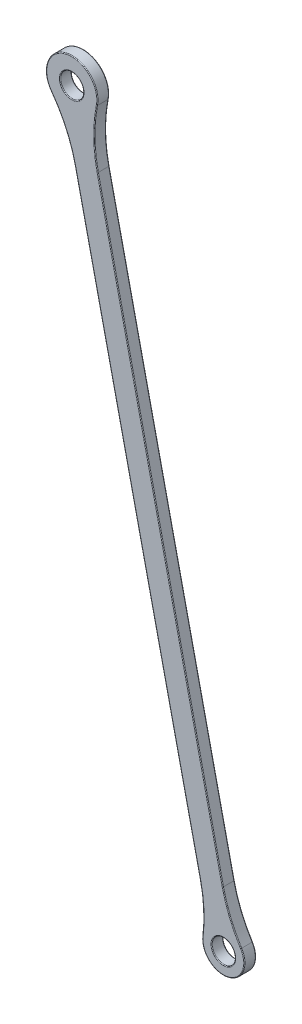
ISO-10303-21;
HEADER;
FILE_DESCRIPTION(('STEP AP214'),'2;1');
FILE_NAME('part.step','',(''),(''),'','','');
FILE_SCHEMA(('AUTOMOTIVE_DESIGN { 1 0 10303 214 1 1 1 1 }'));
ENDSEC;
DATA;
#1=APPLICATION_CONTEXT('core data for automotive mechanical design processes');
#2=APPLICATION_PROTOCOL_DEFINITION('international standard','automotive_design',2000,#1);
#3=PRODUCT_CONTEXT('',#1,'mechanical');
#4=PRODUCT('Part','Part','',(#3));
#5=PRODUCT_RELATED_PRODUCT_CATEGORY('part','',(#4));
#6=PRODUCT_DEFINITION_FORMATION('','',#4);
#7=PRODUCT_DEFINITION_CONTEXT('part definition',#1,'design');
#8=PRODUCT_DEFINITION('design','',#6,#7);
#9=PRODUCT_DEFINITION_SHAPE('','',#8);
#10=(LENGTH_UNIT() NAMED_UNIT(*) SI_UNIT(.MILLI.,.METRE.));
#11=(NAMED_UNIT(*) PLANE_ANGLE_UNIT() SI_UNIT($,.RADIAN.));
#12=(NAMED_UNIT(*) SI_UNIT($,.STERADIAN.) SOLID_ANGLE_UNIT());
#13=UNCERTAINTY_MEASURE_WITH_UNIT(LENGTH_MEASURE(1.E-05),#10,'distance_accuracy_value','');
#14=(GEOMETRIC_REPRESENTATION_CONTEXT(3) GLOBAL_UNCERTAINTY_ASSIGNED_CONTEXT((#13)) GLOBAL_UNIT_ASSIGNED_CONTEXT((#10,
#11,#12)) REPRESENTATION_CONTEXT('',''));
#15=CARTESIAN_POINT('',(0.,0.,0.));
#16=DIRECTION('',(0.,0.,1.));
#17=DIRECTION('',(1.,0.,0.));
#18=AXIS2_PLACEMENT_3D('',#15,#16,#17);
#19=CARTESIAN_POINT('',(28.8140334690027,6.4822013476046,-2.5));
#20=DIRECTION('',(0.975616689085578,0.219481379569418,0.));
#21=DIRECTION('',(-0.219481379569418,0.975616689085578,0.));
#22=AXIS2_PLACEMENT_3D('',#19,#20,#21);
#23=PLANE('',#22);
#24=DIRECTION('',(0.,0.,1.));
#25=VECTOR('',#24,1.);
#26=CARTESIAN_POINT('',(-17.2874647734743,211.407973025582,-2.5));
#27=LINE('',#26,#25);
#28=CARTESIAN_POINT('',(-17.2874647734743,211.407973025582,-0.15));
#29=VERTEX_POINT('',#28);
#30=CARTESIAN_POINT('',(-17.2874647734743,211.407973025582,-2.35));
#31=VERTEX_POINT('',#30);
#32=EDGE_CURVE('E302',#29,#31,#27,.F.);
#33=ORIENTED_EDGE('',*,*,#32,.T.);
#34=DIRECTION('',(-0.219481379569418,0.975616689085578,0.));
#35=VECTOR('',#34,1.);
#36=CARTESIAN_POINT('',(28.8140334690027,6.4822013476046,-2.35));
#37=LINE('',#36,#35);
#38=CARTESIAN_POINT('',(9.52027762419108,92.2448762235713,-2.35));
#39=VERTEX_POINT('',#38);
#40=EDGE_CURVE('E215',#31,#39,#37,.F.);
#41=ORIENTED_EDGE('',*,*,#40,.T.);
#42=DIRECTION('',(0.,0.,1.));
#43=VECTOR('',#42,1.);
#44=CARTESIAN_POINT('',(9.52027762419108,92.2448762235713,-2.5));
#45=LINE('',#44,#43);
#46=CARTESIAN_POINT('',(9.52027762419108,92.2448762235713,-0.15));
#47=VERTEX_POINT('',#46);
#48=EDGE_CURVE('E307',#39,#47,#45,.T.);
#49=ORIENTED_EDGE('',*,*,#48,.T.);
#50=DIRECTION('',(-0.219481379569418,0.975616689085578,0.));
#51=VECTOR('',#50,1.);
#52=CARTESIAN_POINT('',(-17.2874647734743,211.407973025582,-0.15));
#53=LINE('',#52,#51);
#54=EDGE_CURVE('E213',#47,#29,#53,.T.);
#55=ORIENTED_EDGE('',*,*,#54,.T.);
#56=EDGE_LOOP('',(#33,#41,#49,#55));
#57=FACE_BOUND('',#56,.T.);
#58=ADVANCED_FACE('F35',(#57),#23,.F.);
#59=CARTESIAN_POINT('',(-17.983244177946,225.891269992099,-2.5));
#60=DIRECTION('',(0.,0.,1.));
#61=DIRECTION('',(1.,0.,0.));
#62=AXIS2_PLACEMENT_3D('',#59,#60,#61);
#63=CYLINDRICAL_SURFACE('',#62,5.50000000000001);
#64=DIRECTION('',(0.,0.,1.));
#65=VECTOR('',#64,1.);
#66=CARTESIAN_POINT('',(-12.5851315195356,224.837524421712,-2.5));
#67=LINE('',#66,#65);
#68=CARTESIAN_POINT('',(-12.5851315195356,224.837524421712,-0.15));
#69=VERTEX_POINT('',#68);
#70=CARTESIAN_POINT('',(-12.5851315195356,224.837524421712,-2.35));
#71=VERTEX_POINT('',#70);
#72=EDGE_CURVE('E342',#69,#71,#67,.F.);
#73=ORIENTED_EDGE('',*,*,#72,.T.);
#74=CARTESIAN_POINT('',(-17.983244177946,225.891269992099,-2.35));
#75=DIRECTION('',(0.,0.,1.));
#76=DIRECTION('',(1.,0.,0.));
#77=AXIS2_PLACEMENT_3D('',#74,#75,#76);
#78=CIRCLE('',#77,5.50000000000001);
#79=CARTESIAN_POINT('',(-22.4100038110312,222.627254190837,-2.35));
#80=VERTEX_POINT('',#79);
#81=EDGE_CURVE('E206',#71,#80,#78,.T.);
#82=ORIENTED_EDGE('',*,*,#81,.T.);
#83=DIRECTION('',(0.,0.,1.));
#84=VECTOR('',#83,1.);
#85=CARTESIAN_POINT('',(-22.4100038110312,222.627254190837,-2.5));
#86=LINE('',#85,#84);
#87=CARTESIAN_POINT('',(-22.4100038110312,222.627254190837,-0.15));
#88=VERTEX_POINT('',#87);
#89=EDGE_CURVE('E337',#80,#88,#86,.T.);
#90=ORIENTED_EDGE('',*,*,#89,.T.);
#91=CARTESIAN_POINT('',(-17.983244177946,225.891269992099,-0.15));
#92=DIRECTION('',(0.,0.,1.));
#93=DIRECTION('',(1.,0.,0.));
#94=AXIS2_PLACEMENT_3D('',#91,#92,#93);
#95=CIRCLE('',#94,5.50000000000001);
#96=EDGE_CURVE('E204',#88,#69,#95,.F.);
#97=ORIENTED_EDGE('',*,*,#96,.T.);
#98=EDGE_LOOP('',(#73,#82,#90,#97));
#99=FACE_BOUND('',#98,.T.);
#100=ADVANCED_FACE('F371',(#99),#63,.T.);
#101=CARTESIAN_POINT('',(33.6921169144306,7.57960824545169,-2.5));
#102=DIRECTION('',(0.975616689085578,0.219481379569418,0.));
#103=DIRECTION('',(-0.219481379569418,0.975616689085578,0.));
#104=AXIS2_PLACEMENT_3D('',#101,#102,#103);
#105=PLANE('',#104);
#106=DIRECTION('',(0.,0.,-1.));
#107=VECTOR('',#106,1.);
#108=CARTESIAN_POINT('',(14.398361069619,93.3422831214184,-2.5));
#109=LINE('',#108,#107);
#110=CARTESIAN_POINT('',(14.398361069619,93.3422831214184,-0.15));
#111=VERTEX_POINT('',#110);
#112=CARTESIAN_POINT('',(14.398361069619,93.3422831214184,-2.35));
#113=VERTEX_POINT('',#112);
#114=EDGE_CURVE('E258',#111,#113,#109,.T.);
#115=ORIENTED_EDGE('',*,*,#114,.T.);
#116=DIRECTION('',(-0.219481379569418,0.975616689085578,0.));
#117=VECTOR('',#116,1.);
#118=CARTESIAN_POINT('',(-12.4093813280464,212.505379923429,-2.35));
#119=LINE('',#118,#117);
#120=CARTESIAN_POINT('',(-12.4093813280464,212.505379923429,-2.35));
#121=VERTEX_POINT('',#120);
#122=EDGE_CURVE('E198',#113,#121,#119,.T.);
#123=ORIENTED_EDGE('',*,*,#122,.T.);
#124=DIRECTION('',(0.,0.,-1.));
#125=VECTOR('',#124,1.);
#126=CARTESIAN_POINT('',(-12.4093813280464,212.505379923429,0.));
#127=LINE('',#126,#125);
#128=CARTESIAN_POINT('',(-12.4093813280464,212.505379923429,-0.15));
#129=VERTEX_POINT('',#128);
#130=EDGE_CURVE('E335',#121,#129,#127,.F.);
#131=ORIENTED_EDGE('',*,*,#130,.T.);
#132=DIRECTION('',(-0.219481379569418,0.975616689085578,0.));
#133=VECTOR('',#132,1.);
#134=CARTESIAN_POINT('',(33.6921169144306,7.57960824545169,-0.15));
#135=LINE('',#134,#133);
#136=EDGE_CURVE('E196',#129,#111,#135,.F.);
#137=ORIENTED_EDGE('',*,*,#136,.T.);
#138=EDGE_LOOP('',(#115,#123,#131,#137));
#139=FACE_BOUND('',#138,.T.);
#140=ADVANCED_FACE('F334',(#139),#105,.T.);
#141=CARTESIAN_POINT('',(-17.983244177946,225.891269992099,-2.5));
#142=DIRECTION('',(0.,0.,1.));
#143=DIRECTION('',(1.,0.,0.));
#144=AXIS2_PLACEMENT_3D('',#141,#142,#143);
#145=CYLINDRICAL_SURFACE('',#144,2.50000000000001);
#146=CARTESIAN_POINT('',(-17.983244177946,225.891269992099,-2.35));
#147=DIRECTION('',(0.,0.,1.));
#148=DIRECTION('',(1.,0.,0.));
#149=AXIS2_PLACEMENT_3D('',#146,#147,#148);
#150=CIRCLE('',#149,2.50000000000001);
#151=CARTESIAN_POINT('',(-15.483244177946,225.891269992099,-2.35));
#152=VERTEX_POINT('',#151);
#153=EDGE_CURVE('E190',#152,#152,#150,.F.);
#154=ORIENTED_EDGE('',*,*,#153,.T.);
#155=EDGE_LOOP('',(#154));
#156=FACE_BOUND('',#155,.T.);
#157=CARTESIAN_POINT('',(-17.983244177946,225.891269992099,-0.15));
#158=DIRECTION('',(0.,0.,1.));
#159=DIRECTION('',(1.,0.,0.));
#160=AXIS2_PLACEMENT_3D('',#157,#158,#159);
#161=CIRCLE('',#160,2.50000000000001);
#162=CARTESIAN_POINT('',(-15.483244177946,225.891269992099,-0.15));
#163=VERTEX_POINT('',#162);
#164=EDGE_CURVE('E187',#163,#163,#161,.T.);
#165=ORIENTED_EDGE('',*,*,#164,.T.);
#166=EDGE_LOOP('',(#165));
#167=FACE_BOUND('',#166,.T.);
#168=ADVANCED_FACE('F640',(#156,#167),#145,.F.);
#169=CARTESIAN_POINT('',(14.5,81.5,-2.5));
#170=DIRECTION('',(0.,0.,1.));
#171=DIRECTION('',(1.,0.,0.));
#172=AXIS2_PLACEMENT_3D('',#169,#170,#171);
#173=CYLINDRICAL_SURFACE('',#172,4.5);
#174=DIRECTION('',(0.,0.,1.));
#175=VECTOR('',#174,1.);
#176=CARTESIAN_POINT('',(10.0328404719509,82.0426654134551,-2.5));
#177=LINE('',#176,#175);
#178=CARTESIAN_POINT('',(10.0328404719509,82.0426654134551,-0.15));
#179=VERTEX_POINT('',#178);
#180=CARTESIAN_POINT('',(10.0328404719509,82.0426654134551,-2.35));
#181=VERTEX_POINT('',#180);
#182=EDGE_CURVE('E301',#179,#181,#177,.F.);
#183=ORIENTED_EDGE('',*,*,#182,.T.);
#184=CARTESIAN_POINT('',(14.5,81.5,-2.35));
#185=DIRECTION('',(0.,0.,1.));
#186=DIRECTION('',(1.,0.,0.));
#187=AXIS2_PLACEMENT_3D('',#184,#185,#186);
#188=CIRCLE('',#187,4.5);
#189=CARTESIAN_POINT('',(18.30437327072,83.9034858054566,-2.35));
#190=VERTEX_POINT('',#189);
#191=EDGE_CURVE('E223',#181,#190,#188,.T.);
#192=ORIENTED_EDGE('',*,*,#191,.T.);
#193=DIRECTION('',(0.,0.,1.));
#194=VECTOR('',#193,1.);
#195=CARTESIAN_POINT('',(18.30437327072,83.9034858054566,-2.5));
#196=LINE('',#195,#194);
#197=CARTESIAN_POINT('',(18.30437327072,83.9034858054566,-0.15));
#198=VERTEX_POINT('',#197);
#199=EDGE_CURVE('E295',#190,#198,#196,.T.);
#200=ORIENTED_EDGE('',*,*,#199,.T.);
#201=CARTESIAN_POINT('',(14.5,81.5,-0.15));
#202=DIRECTION('',(0.,0.,1.));
#203=DIRECTION('',(1.,0.,0.));
#204=AXIS2_PLACEMENT_3D('',#201,#202,#203);
#205=CIRCLE('',#204,4.5);
#206=EDGE_CURVE('E221',#198,#179,#205,.F.);
#207=ORIENTED_EDGE('',*,*,#206,.T.);
#208=EDGE_LOOP('',(#183,#192,#200,#207));
#209=FACE_BOUND('',#208,.T.);
#210=ADVANCED_FACE('F299',(#209),#173,.T.);
#211=CARTESIAN_POINT('',(14.5,81.5,-2.5));
#212=DIRECTION('',(0.,0.,1.));
#213=DIRECTION('',(1.,0.,0.));
#214=AXIS2_PLACEMENT_3D('',#211,#212,#213);
#215=CYLINDRICAL_SURFACE('',#214,2.50000000000001);
#216=CARTESIAN_POINT('',(14.5,81.5,-2.35));
#217=DIRECTION('',(0.,0.,1.));
#218=DIRECTION('',(1.,0.,0.));
#219=AXIS2_PLACEMENT_3D('',#216,#217,#218);
#220=CIRCLE('',#219,2.50000000000001);
#221=CARTESIAN_POINT('',(17.,81.5,-2.35));
#222=VERTEX_POINT('',#221);
#223=EDGE_CURVE('E170',#222,#222,#220,.F.);
#224=ORIENTED_EDGE('',*,*,#223,.T.);
#225=EDGE_LOOP('',(#224));
#226=FACE_BOUND('',#225,.T.);
#227=CARTESIAN_POINT('',(14.5,81.5,-0.15));
#228=DIRECTION('',(0.,0.,1.));
#229=DIRECTION('',(1.,0.,0.));
#230=AXIS2_PLACEMENT_3D('',#227,#228,#229);
#231=CIRCLE('',#230,2.50000000000001);
#232=CARTESIAN_POINT('',(17.,81.5,-0.15));
#233=VERTEX_POINT('',#232);
#234=EDGE_CURVE('E304',#233,#233,#231,.T.);
#235=ORIENTED_EDGE('',*,*,#234,.T.);
#236=EDGE_LOOP('',(#235));
#237=FACE_BOUND('',#236,.T.);
#238=ADVANCED_FACE('F617',(#226,#237),#215,.F.);
#239=CARTESIAN_POINT('',(0.,0.,-2.5));
#240=DIRECTION('',(0.,0.,1.));
#241=DIRECTION('',(1.,0.,0.));
#242=AXIS2_PLACEMENT_3D('',#239,#240,#241);
#243=PLANE('',#242);
#244=CARTESIAN_POINT('',(14.5,81.5,-2.5));
#245=DIRECTION('',(0.,0.,1.));
#246=DIRECTION('',(1.,0.,0.));
#247=AXIS2_PLACEMENT_3D('',#244,#245,#246);
#248=CIRCLE('',#247,2.65000000000001);
#249=CARTESIAN_POINT('',(17.15,81.5,-2.5));
#250=VERTEX_POINT('',#249);
#251=EDGE_CURVE('E179',#250,#250,#248,.T.);
#252=ORIENTED_EDGE('',*,*,#251,.T.);
#253=EDGE_LOOP('',(#252));
#254=FACE_BOUND('',#253,.T.);
#255=CARTESIAN_POINT('',(-17.983244177946,225.891269992099,-2.5));
#256=DIRECTION('',(0.,0.,1.));
#257=DIRECTION('',(1.,0.,0.));
#258=AXIS2_PLACEMENT_3D('',#255,#256,#257);
#259=CIRCLE('',#258,2.65000000000001);
#260=CARTESIAN_POINT('',(-15.333244177946,225.891269992099,-2.5));
#261=VERTEX_POINT('',#260);
#262=EDGE_CURVE('E176',#261,#261,#259,.T.);
#263=ORIENTED_EDGE('',*,*,#262,.T.);
#264=EDGE_LOOP('',(#263));
#265=FACE_BOUND('',#264,.T.);
#266=DIRECTION('',(-0.219481379569418,0.975616689085578,0.));
#267=VECTOR('',#266,1.);
#268=CARTESIAN_POINT('',(14.2520185662561,93.309360914483,-2.5));
#269=LINE('',#268,#267);
#270=CARTESIAN_POINT('',(-12.5557238314092,212.472457716494,-2.5));
#271=VERTEX_POINT('',#270);
#272=CARTESIAN_POINT('',(14.2520185662561,93.309360914483,-2.5));
#273=VERTEX_POINT('',#272);
#274=EDGE_CURVE('E174',#271,#273,#269,.F.);
#275=ORIENTED_EDGE('',*,*,#274,.T.);
#276=CARTESIAN_POINT('',(43.6668617421863,99.9267245085009,-2.5));
#277=DIRECTION('',(0.,0.,1.));
#278=DIRECTION('',(1.,0.,0.));
#279=AXIS2_PLACEMENT_3D('',#276,#277,#278);
#280=CIRCLE('',#279,30.15);
#281=CARTESIAN_POINT('',(18.1775608283626,83.8233696119414,-2.5));
#282=VERTEX_POINT('',#281);
#283=EDGE_CURVE('E155',#273,#282,#280,.T.);
#284=ORIENTED_EDGE('',*,*,#283,.T.);
#285=CARTESIAN_POINT('',(14.5,81.5,-2.5));
#286=DIRECTION('',(0.,0.,1.));
#287=DIRECTION('',(1.,0.,0.));
#288=AXIS2_PLACEMENT_3D('',#285,#286,#287);
#289=CIRCLE('',#288,4.35);
#290=CARTESIAN_POINT('',(10.1817457895526,82.0245765663399,-2.5));
#291=VERTEX_POINT('',#290);
#292=EDGE_CURVE('E163',#282,#291,#289,.F.);
#293=ORIENTED_EDGE('',*,*,#292,.T.);
#294=CARTESIAN_POINT('',(-19.7482230483763,85.6604348364887,-2.5));
#295=DIRECTION('',(0.,0.,1.));
#296=DIRECTION('',(1.,0.,0.));
#297=AXIS2_PLACEMENT_3D('',#294,#295,#296);
#298=CIRCLE('',#297,30.15);
#299=CARTESIAN_POINT('',(9.66662012755392,92.2777984305067,-2.5));
#300=VERTEX_POINT('',#299);
#301=EDGE_CURVE('E169',#291,#300,#298,.T.);
#302=ORIENTED_EDGE('',*,*,#301,.T.);
#303=DIRECTION('',(-0.219481379569418,0.975616689085578,0.));
#304=VECTOR('',#303,1.);
#305=CARTESIAN_POINT('',(28.9603759723655,6.51512355454001,-2.5));
#306=LINE('',#305,#304);
#307=CARTESIAN_POINT('',(-17.1411222701114,211.440895232517,-2.5));
#308=VERTEX_POINT('',#307);
#309=EDGE_CURVE('E316',#300,#308,#306,.T.);
#310=ORIENTED_EDGE('',*,*,#309,.T.);
#311=CARTESIAN_POINT('',(-46.5559654460416,204.823531638499,-2.5));
#312=DIRECTION('',(0.,0.,1.));
#313=DIRECTION('',(1.,0.,0.));
#314=AXIS2_PLACEMENT_3D('',#311,#312,#313);
#315=CIRCLE('',#314,30.15);
#316=CARTESIAN_POINT('',(-22.2892740028562,222.716272803598,-2.5));
#317=VERTEX_POINT('',#316);
#318=EDGE_CURVE('E318',#308,#317,#315,.T.);
#319=ORIENTED_EDGE('',*,*,#318,.T.);
#320=CARTESIAN_POINT('',(-17.983244177946,225.891269992099,-2.5));
#321=DIRECTION('',(0.,0.,1.));
#322=DIRECTION('',(1.,0.,0.));
#323=AXIS2_PLACEMENT_3D('',#320,#321,#322);
#324=CIRCLE('',#323,5.35000000000001);
#325=CARTESIAN_POINT('',(-12.7323527738559,224.866262937268,-2.5));
#326=VERTEX_POINT('',#325);
#327=EDGE_CURVE('E320',#317,#326,#324,.F.);
#328=ORIENTED_EDGE('',*,*,#327,.T.);
#329=CARTESIAN_POINT('',(16.859119344521,219.089821310511,-2.5));
#330=DIRECTION('',(0.,0.,1.));
#331=DIRECTION('',(1.,0.,0.));
#332=AXIS2_PLACEMENT_3D('',#329,#330,#331);
#333=CIRCLE('',#332,30.15);
#334=EDGE_CURVE('E181',#326,#271,#333,.T.);
#335=ORIENTED_EDGE('',*,*,#334,.T.);
#336=EDGE_LOOP('',(#275,#284,#293,#302,#310,#319,#328,#335));
#337=FACE_BOUND('',#336,.T.);
#338=ADVANCED_FACE('F172',(#254,#265,#337),#243,.F.);
#339=CARTESIAN_POINT('',(0.,0.,0.));
#340=DIRECTION('',(0.,0.,1.));
#341=DIRECTION('',(1.,0.,0.));
#342=AXIS2_PLACEMENT_3D('',#339,#340,#341);
#343=PLANE('',#342);
#344=CARTESIAN_POINT('',(14.5,81.5,0.));
#345=DIRECTION('',(0.,0.,1.));
#346=DIRECTION('',(1.,0.,0.));
#347=AXIS2_PLACEMENT_3D('',#344,#345,#346);
#348=CIRCLE('',#347,2.65000000000001);
#349=CARTESIAN_POINT('',(17.15,81.5,0.));
#350=VERTEX_POINT('',#349);
#351=EDGE_CURVE('E11',#350,#350,#348,.F.);
#352=ORIENTED_EDGE('',*,*,#351,.T.);
#353=EDGE_LOOP('',(#352));
#354=FACE_BOUND('',#353,.T.);
#355=CARTESIAN_POINT('',(-17.983244177946,225.891269992099,0.));
#356=DIRECTION('',(0.,0.,1.));
#357=DIRECTION('',(1.,0.,0.));
#358=AXIS2_PLACEMENT_3D('',#355,#356,#357);
#359=CIRCLE('',#358,2.65000000000001);
#360=CARTESIAN_POINT('',(-15.333244177946,225.891269992099,0.));
#361=VERTEX_POINT('',#360);
#362=EDGE_CURVE('E44',#361,#361,#359,.F.);
#363=ORIENTED_EDGE('',*,*,#362,.T.);
#364=EDGE_LOOP('',(#363));
#365=FACE_BOUND('',#364,.T.);
#366=CARTESIAN_POINT('',(-17.983244177946,225.891269992099,0.));
#367=DIRECTION('',(0.,0.,1.));
#368=DIRECTION('',(1.,0.,0.));
#369=AXIS2_PLACEMENT_3D('',#366,#367,#368);
#370=CIRCLE('',#369,5.35000000000001);
#371=CARTESIAN_POINT('',(-12.7323527738559,224.866262937268,0.));
#372=VERTEX_POINT('',#371);
#373=CARTESIAN_POINT('',(-22.2892740028562,222.716272803598,0.));
#374=VERTEX_POINT('',#373);
#375=EDGE_CURVE('E52',#372,#374,#370,.T.);
#376=ORIENTED_EDGE('',*,*,#375,.T.);
#377=CARTESIAN_POINT('',(-46.5559654460416,204.823531638499,0.));
#378=DIRECTION('',(0.,0.,1.));
#379=DIRECTION('',(1.,0.,0.));
#380=AXIS2_PLACEMENT_3D('',#377,#378,#379);
#381=CIRCLE('',#380,30.15);
#382=CARTESIAN_POINT('',(-17.1411222701114,211.440895232517,0.));
#383=VERTEX_POINT('',#382);
#384=EDGE_CURVE('E237',#374,#383,#381,.F.);
#385=ORIENTED_EDGE('',*,*,#384,.T.);
#386=DIRECTION('',(-0.219481379569418,0.975616689085578,0.));
#387=VECTOR('',#386,1.);
#388=CARTESIAN_POINT('',(9.66662012755392,92.2777984305067,0.));
#389=LINE('',#388,#387);
#390=CARTESIAN_POINT('',(9.66662012755392,92.2777984305067,0.));
#391=VERTEX_POINT('',#390);
#392=EDGE_CURVE('E225',#383,#391,#389,.F.);
#393=ORIENTED_EDGE('',*,*,#392,.T.);
#394=CARTESIAN_POINT('',(-19.7482230483763,85.6604348364887,0.));
#395=DIRECTION('',(0.,0.,1.));
#396=DIRECTION('',(1.,0.,0.));
#397=AXIS2_PLACEMENT_3D('',#394,#395,#396);
#398=CIRCLE('',#397,30.15);
#399=CARTESIAN_POINT('',(10.1817457895526,82.0245765663399,0.));
#400=VERTEX_POINT('',#399);
#401=EDGE_CURVE('E227',#391,#400,#398,.F.);
#402=ORIENTED_EDGE('',*,*,#401,.T.);
#403=CARTESIAN_POINT('',(14.5,81.5,0.));
#404=DIRECTION('',(0.,0.,1.));
#405=DIRECTION('',(1.,0.,0.));
#406=AXIS2_PLACEMENT_3D('',#403,#404,#405);
#407=CIRCLE('',#406,4.35);
#408=CARTESIAN_POINT('',(18.1775608283626,83.8233696119414,0.));
#409=VERTEX_POINT('',#408);
#410=EDGE_CURVE('E229',#400,#409,#407,.T.);
#411=ORIENTED_EDGE('',*,*,#410,.T.);
#412=CARTESIAN_POINT('',(43.6668617421863,99.9267245085009,0.));
#413=DIRECTION('',(0.,0.,1.));
#414=DIRECTION('',(1.,0.,0.));
#415=AXIS2_PLACEMENT_3D('',#412,#413,#414);
#416=CIRCLE('',#415,30.15);
#417=CARTESIAN_POINT('',(14.2520185662561,93.309360914483,0.));
#418=VERTEX_POINT('',#417);
#419=EDGE_CURVE('E231',#409,#418,#416,.F.);
#420=ORIENTED_EDGE('',*,*,#419,.T.);
#421=DIRECTION('',(-0.219481379569418,0.975616689085578,0.));
#422=VECTOR('',#421,1.);
#423=CARTESIAN_POINT('',(33.5457744110677,7.54668603851628,0.));
#424=LINE('',#423,#422);
#425=CARTESIAN_POINT('',(-12.5557238314092,212.472457716494,0.));
#426=VERTEX_POINT('',#425);
#427=EDGE_CURVE('E233',#418,#426,#424,.T.);
#428=ORIENTED_EDGE('',*,*,#427,.T.);
#429=CARTESIAN_POINT('',(16.859119344521,219.089821310511,0.));
#430=DIRECTION('',(0.,0.,1.));
#431=DIRECTION('',(1.,0.,0.));
#432=AXIS2_PLACEMENT_3D('',#429,#430,#431);
#433=CIRCLE('',#432,30.15);
#434=EDGE_CURVE('E57',#426,#372,#433,.F.);
#435=ORIENTED_EDGE('',*,*,#434,.T.);
#436=EDGE_LOOP('',(#376,#385,#393,#402,#411,#420,#428,#435));
#437=FACE_BOUND('',#436,.T.);
#438=ADVANCED_FACE('F390',(#354,#365,#437),#343,.T.);
#439=CARTESIAN_POINT('',(16.859119344521,219.089821310511,-2.5));
#440=DIRECTION('',(0.,0.,1.));
#441=DIRECTION('',(1.,0.,0.));
#442=AXIS2_PLACEMENT_3D('',#439,#440,#441);
#443=CYLINDRICAL_SURFACE('',#442,30.);
#444=ORIENTED_EDGE('',*,*,#130,.F.);
#445=CARTESIAN_POINT('',(16.859119344521,219.089821310511,-2.35));
#446=DIRECTION('',(0.,0.,1.));
#447=DIRECTION('',(1.,0.,0.));
#448=AXIS2_PLACEMENT_3D('',#445,#446,#447);
#449=CIRCLE('',#448,30.);
#450=EDGE_CURVE('E202',#121,#71,#449,.F.);
#451=ORIENTED_EDGE('',*,*,#450,.T.);
#452=ORIENTED_EDGE('',*,*,#72,.F.);
#453=CARTESIAN_POINT('',(16.859119344521,219.089821310511,-0.15));
#454=DIRECTION('',(0.,0.,1.));
#455=DIRECTION('',(1.,0.,0.));
#456=AXIS2_PLACEMENT_3D('',#453,#454,#455);
#457=CIRCLE('',#456,30.);
#458=EDGE_CURVE('E200',#69,#129,#457,.T.);
#459=ORIENTED_EDGE('',*,*,#458,.T.);
#460=EDGE_LOOP('',(#444,#451,#452,#459));
#461=FACE_BOUND('',#460,.T.);
#462=ADVANCED_FACE('F413',(#461),#443,.F.);
#463=CARTESIAN_POINT('',(-46.5559654460416,204.823531638499,-2.5));
#464=DIRECTION('',(0.,0.,1.));
#465=DIRECTION('',(1.,0.,0.));
#466=AXIS2_PLACEMENT_3D('',#463,#464,#465);
#467=CYLINDRICAL_SURFACE('',#466,30.);
#468=ORIENTED_EDGE('',*,*,#89,.F.);
#469=CARTESIAN_POINT('',(-46.5559654460416,204.823531638499,-2.35));
#470=DIRECTION('',(0.,0.,1.));
#471=DIRECTION('',(1.,0.,0.));
#472=AXIS2_PLACEMENT_3D('',#469,#470,#471);
#473=CIRCLE('',#472,30.);
#474=EDGE_CURVE('E211',#80,#31,#473,.F.);
#475=ORIENTED_EDGE('',*,*,#474,.T.);
#476=ORIENTED_EDGE('',*,*,#32,.F.);
#477=CARTESIAN_POINT('',(-46.5559654460416,204.823531638499,-0.15));
#478=DIRECTION('',(0.,0.,1.));
#479=DIRECTION('',(1.,0.,0.));
#480=AXIS2_PLACEMENT_3D('',#477,#478,#479);
#481=CIRCLE('',#480,30.);
#482=EDGE_CURVE('E208',#29,#88,#481,.T.);
#483=ORIENTED_EDGE('',*,*,#482,.T.);
#484=EDGE_LOOP('',(#468,#475,#476,#483));
#485=FACE_BOUND('',#484,.T.);
#486=ADVANCED_FACE('F368',(#485),#467,.F.);
#487=CARTESIAN_POINT('',(-19.7482230483763,85.6604348364887,-2.5));
#488=DIRECTION('',(0.,0.,1.));
#489=DIRECTION('',(1.,0.,0.));
#490=AXIS2_PLACEMENT_3D('',#487,#488,#489);
#491=CYLINDRICAL_SURFACE('',#490,30.);
#492=ORIENTED_EDGE('',*,*,#48,.F.);
#493=CARTESIAN_POINT('',(-19.7482230483763,85.6604348364887,-2.35));
#494=DIRECTION('',(0.,0.,1.));
#495=DIRECTION('',(1.,0.,0.));
#496=AXIS2_PLACEMENT_3D('',#493,#494,#495);
#497=CIRCLE('',#496,30.);
#498=EDGE_CURVE('E219',#39,#181,#497,.F.);
#499=ORIENTED_EDGE('',*,*,#498,.T.);
#500=ORIENTED_EDGE('',*,*,#182,.F.);
#501=CARTESIAN_POINT('',(-19.7482230483763,85.6604348364887,-0.15));
#502=DIRECTION('',(0.,0.,1.));
#503=DIRECTION('',(1.,0.,0.));
#504=AXIS2_PLACEMENT_3D('',#501,#502,#503);
#505=CIRCLE('',#504,30.);
#506=EDGE_CURVE('E217',#179,#47,#505,.T.);
#507=ORIENTED_EDGE('',*,*,#506,.T.);
#508=EDGE_LOOP('',(#492,#499,#500,#507));
#509=FACE_BOUND('',#508,.T.);
#510=ADVANCED_FACE('F387',(#509),#491,.F.);
#511=CARTESIAN_POINT('',(43.6668617421863,99.9267245085009,-2.5));
#512=DIRECTION('',(0.,0.,1.));
#513=DIRECTION('',(1.,0.,0.));
#514=AXIS2_PLACEMENT_3D('',#511,#512,#513);
#515=CYLINDRICAL_SURFACE('',#514,30.);
#516=ORIENTED_EDGE('',*,*,#199,.F.);
#517=CARTESIAN_POINT('',(43.6668617421863,99.9267245085009,-2.35));
#518=DIRECTION('',(0.,0.,1.));
#519=DIRECTION('',(1.,0.,0.));
#520=AXIS2_PLACEMENT_3D('',#517,#518,#519);
#521=CIRCLE('',#520,30.);
#522=EDGE_CURVE('E157',#190,#113,#521,.F.);
#523=ORIENTED_EDGE('',*,*,#522,.T.);
#524=ORIENTED_EDGE('',*,*,#114,.F.);
#525=CARTESIAN_POINT('',(43.6668617421863,99.9267245085009,-0.15));
#526=DIRECTION('',(0.,0.,1.));
#527=DIRECTION('',(1.,0.,0.));
#528=AXIS2_PLACEMENT_3D('',#525,#526,#527);
#529=CIRCLE('',#528,30.);
#530=EDGE_CURVE('E193',#111,#198,#529,.T.);
#531=ORIENTED_EDGE('',*,*,#530,.T.);
#532=EDGE_LOOP('',(#516,#523,#524,#531));
#533=FACE_BOUND('',#532,.T.);
#534=ADVANCED_FACE('F294',(#533),#515,.F.);
#535=CARTESIAN_POINT('',(14.5,81.5,-2.35));
#536=DIRECTION('',(0.,0.,1.));
#537=DIRECTION('',(1.,0.,0.));
#538=AXIS2_PLACEMENT_3D('',#535,#536,#537);
#539=TOROIDAL_SURFACE('',#538,2.65000000000001,0.15);
#540=ORIENTED_EDGE('',*,*,#251,.F.);
#541=EDGE_LOOP('',(#540));
#542=FACE_BOUND('',#541,.T.);
#543=ORIENTED_EDGE('',*,*,#223,.F.);
#544=EDGE_LOOP('',(#543));
#545=FACE_BOUND('',#544,.T.);
#546=ADVANCED_FACE('F423',(#542,#545),#539,.T.);
#547=CARTESIAN_POINT('',(-17.983244177946,225.891269992099,-2.35));
#548=DIRECTION('',(0.,0.,1.));
#549=DIRECTION('',(1.,0.,0.));
#550=AXIS2_PLACEMENT_3D('',#547,#548,#549);
#551=TOROIDAL_SURFACE('',#550,2.65000000000001,0.15);
#552=ORIENTED_EDGE('',*,*,#153,.F.);
#553=EDGE_LOOP('',(#552));
#554=FACE_BOUND('',#553,.T.);
#555=ORIENTED_EDGE('',*,*,#262,.F.);
#556=EDGE_LOOP('',(#555));
#557=FACE_BOUND('',#556,.T.);
#558=ADVANCED_FACE('F426',(#554,#557),#551,.T.);
#559=CARTESIAN_POINT('',(-46.5559654460416,204.823531638499,-2.35));
#560=DIRECTION('',(0.,0.,1.));
#561=DIRECTION('',(1.,0.,0.));
#562=AXIS2_PLACEMENT_3D('',#559,#560,#561);
#563=TOROIDAL_SURFACE('',#562,30.15,0.15);
#564=CARTESIAN_POINT('',(-17.1411222701114,211.440895232517,-2.35));
#565=DIRECTION('',(0.219481379569361,-0.975616689085591,0.));
#566=DIRECTION('',(0.975616689085591,0.219481379569361,0.));
#567=AXIS2_PLACEMENT_3D('',#564,#565,#566);
#568=CIRCLE('',#567,0.15);
#569=EDGE_CURVE('E252',#31,#308,#568,.T.);
#570=ORIENTED_EDGE('',*,*,#569,.F.);
#571=ORIENTED_EDGE('',*,*,#474,.F.);
#572=CARTESIAN_POINT('',(-22.2892740028562,222.716272803598,-2.35));
#573=DIRECTION('',(-0.593457418411322,0.804865387833624,0.));
#574=DIRECTION('',(-0.804865387833624,-0.593457418411322,0.));
#575=AXIS2_PLACEMENT_3D('',#572,#573,#574);
#576=CIRCLE('',#575,0.15);
#577=EDGE_CURVE('E255',#317,#80,#576,.T.);
#578=ORIENTED_EDGE('',*,*,#577,.F.);
#579=ORIENTED_EDGE('',*,*,#318,.F.);
#580=EDGE_LOOP('',(#570,#571,#578,#579));
#581=FACE_BOUND('',#580,.T.);
#582=ADVANCED_FACE('F380',(#581),#563,.T.);
#583=CARTESIAN_POINT('',(-17.983244177946,225.891269992099,-2.35));
#584=DIRECTION('',(0.,0.,1.));
#585=DIRECTION('',(1.,0.,0.));
#586=AXIS2_PLACEMENT_3D('',#583,#584,#585);
#587=TOROIDAL_SURFACE('',#586,5.35000000000001,0.15);
#588=ORIENTED_EDGE('',*,*,#577,.T.);
#589=ORIENTED_EDGE('',*,*,#81,.F.);
#590=CARTESIAN_POINT('',(-12.7323527738559,224.866262937268,-2.35));
#591=DIRECTION('',(-0.191590103706767,-0.981475028801869,0.));
#592=DIRECTION('',(0.981475028801869,-0.191590103706767,0.));
#593=AXIS2_PLACEMENT_3D('',#590,#591,#592);
#594=CIRCLE('',#593,0.15);
#595=EDGE_CURVE('E249',#326,#71,#594,.T.);
#596=ORIENTED_EDGE('',*,*,#595,.F.);
#597=ORIENTED_EDGE('',*,*,#327,.F.);
#598=EDGE_LOOP('',(#588,#589,#596,#597));
#599=FACE_BOUND('',#598,.T.);
#600=ADVANCED_FACE('F375',(#599),#587,.T.);
#601=CARTESIAN_POINT('',(28.9603759723655,6.51512355454001,-2.35));
#602=DIRECTION('',(-0.219481379569418,0.975616689085578,0.));
#603=DIRECTION('',(-0.975616689085578,-0.219481379569418,0.));
#604=AXIS2_PLACEMENT_3D('',#601,#602,#603);
#605=CYLINDRICAL_SURFACE('',#604,0.15);
#606=ORIENTED_EDGE('',*,*,#569,.T.);
#607=ORIENTED_EDGE('',*,*,#309,.F.);
#608=CARTESIAN_POINT('',(9.66662012755392,92.2777984305067,-2.35));
#609=DIRECTION('',(0.219481379569451,-0.97561668908557,0.));
#610=DIRECTION('',(0.975616689085571,0.219481379569451,0.));
#611=AXIS2_PLACEMENT_3D('',#608,#609,#610);
#612=CIRCLE('',#611,0.15);
#613=EDGE_CURVE('E246',#39,#300,#612,.T.);
#614=ORIENTED_EDGE('',*,*,#613,.F.);
#615=ORIENTED_EDGE('',*,*,#40,.F.);
#616=EDGE_LOOP('',(#606,#607,#614,#615));
#617=FACE_BOUND('',#616,.T.);
#618=ADVANCED_FACE('F383',(#617),#605,.T.);
#619=CARTESIAN_POINT('',(16.859119344521,219.089821310511,-2.35));
#620=DIRECTION('',(0.,0.,1.));
#621=DIRECTION('',(1.,0.,0.));
#622=AXIS2_PLACEMENT_3D('',#619,#620,#621);
#623=TOROIDAL_SURFACE('',#622,30.15,0.15);
#624=ORIENTED_EDGE('',*,*,#595,.T.);
#625=ORIENTED_EDGE('',*,*,#450,.F.);
#626=CARTESIAN_POINT('',(-12.5557238314092,212.472457716494,-2.35));
#627=DIRECTION('',(0.219481379569363,-0.97561668908559,0.));
#628=DIRECTION('',(0.97561668908559,0.219481379569363,0.));
#629=AXIS2_PLACEMENT_3D('',#626,#627,#628);
#630=CIRCLE('',#629,0.15);
#631=EDGE_CURVE('E243',#271,#121,#630,.T.);
#632=ORIENTED_EDGE('',*,*,#631,.F.);
#633=ORIENTED_EDGE('',*,*,#334,.F.);
#634=EDGE_LOOP('',(#624,#625,#632,#633));
#635=FACE_BOUND('',#634,.T.);
#636=ADVANCED_FACE('F327',(#635),#623,.T.);
#637=CARTESIAN_POINT('',(-19.7482230483763,85.6604348364887,-2.35));
#638=DIRECTION('',(0.,0.,1.));
#639=DIRECTION('',(1.,0.,0.));
#640=AXIS2_PLACEMENT_3D('',#637,#638,#639);
#641=TOROIDAL_SURFACE('',#640,30.15,0.15);
#642=ORIENTED_EDGE('',*,*,#613,.T.);
#643=ORIENTED_EDGE('',*,*,#301,.F.);
#644=CARTESIAN_POINT('',(10.1817457895526,82.0245765663399,-2.35));
#645=DIRECTION('',(-0.120592314101128,-0.992702117344239,0.));
#646=DIRECTION('',(0.992702117344239,-0.120592314101128,0.));
#647=AXIS2_PLACEMENT_3D('',#644,#645,#646);
#648=CIRCLE('',#647,0.15);
#649=EDGE_CURVE('E166',#181,#291,#648,.T.);
#650=ORIENTED_EDGE('',*,*,#649,.F.);
#651=ORIENTED_EDGE('',*,*,#498,.F.);
#652=EDGE_LOOP('',(#642,#643,#650,#651));
#653=FACE_BOUND('',#652,.T.);
#654=ADVANCED_FACE('F386',(#653),#641,.T.);
#655=CARTESIAN_POINT('',(33.5457744110677,7.54668603851628,-2.35));
#656=DIRECTION('',(0.219481379569418,-0.975616689085578,0.));
#657=DIRECTION('',(0.975616689085578,0.219481379569418,0.));
#658=AXIS2_PLACEMENT_3D('',#655,#656,#657);
#659=CYLINDRICAL_SURFACE('',#658,0.15);
#660=ORIENTED_EDGE('',*,*,#631,.T.);
#661=ORIENTED_EDGE('',*,*,#122,.F.);
#662=CARTESIAN_POINT('',(14.2520185662561,93.309360914483,-2.35));
#663=DIRECTION('',(0.219481379569454,-0.97561668908557,0.));
#664=DIRECTION('',(0.97561668908557,0.219481379569454,0.));
#665=AXIS2_PLACEMENT_3D('',#662,#663,#664);
#666=CIRCLE('',#665,0.15);
#667=EDGE_CURVE('E160',#273,#113,#666,.T.);
#668=ORIENTED_EDGE('',*,*,#667,.F.);
#669=ORIENTED_EDGE('',*,*,#274,.F.);
#670=EDGE_LOOP('',(#660,#661,#668,#669));
#671=FACE_BOUND('',#670,.T.);
#672=ADVANCED_FACE('F330',(#671),#659,.T.);
#673=CARTESIAN_POINT('',(14.5,81.5,-2.35));
#674=DIRECTION('',(0.,0.,1.));
#675=DIRECTION('',(1.,0.,0.));
#676=AXIS2_PLACEMENT_3D('',#673,#674,#675);
#677=TOROIDAL_SURFACE('',#676,4.35,0.15);
#678=ORIENTED_EDGE('',*,*,#649,.T.);
#679=ORIENTED_EDGE('',*,*,#292,.F.);
#680=CARTESIAN_POINT('',(18.1775608283626,83.8233696119414,-2.35));
#681=DIRECTION('',(-0.534107956768149,0.845416282382208,0.));
#682=DIRECTION('',(-0.845416282382208,-0.534107956768149,0.));
#683=AXIS2_PLACEMENT_3D('',#680,#681,#682);
#684=CIRCLE('',#683,0.15);
#685=EDGE_CURVE('E151',#190,#282,#684,.T.);
#686=ORIENTED_EDGE('',*,*,#685,.F.);
#687=ORIENTED_EDGE('',*,*,#191,.F.);
#688=EDGE_LOOP('',(#678,#679,#686,#687));
#689=FACE_BOUND('',#688,.T.);
#690=ADVANCED_FACE('F164',(#689),#677,.T.);
#691=CARTESIAN_POINT('',(43.6668617421863,99.9267245085009,-2.35));
#692=DIRECTION('',(0.,0.,1.));
#693=DIRECTION('',(1.,0.,0.));
#694=AXIS2_PLACEMENT_3D('',#691,#692,#693);
#695=TOROIDAL_SURFACE('',#694,30.15,0.15);
#696=ORIENTED_EDGE('',*,*,#667,.T.);
#697=ORIENTED_EDGE('',*,*,#522,.F.);
#698=ORIENTED_EDGE('',*,*,#685,.T.);
#699=ORIENTED_EDGE('',*,*,#283,.F.);
#700=EDGE_LOOP('',(#696,#697,#698,#699));
#701=FACE_BOUND('',#700,.T.);
#702=ADVANCED_FACE('F153',(#701),#695,.T.);
#703=CARTESIAN_POINT('',(14.5,81.5,-0.15));
#704=DIRECTION('',(0.,0.,1.));
#705=DIRECTION('',(1.,0.,0.));
#706=AXIS2_PLACEMENT_3D('',#703,#704,#705);
#707=TOROIDAL_SURFACE('',#706,2.65000000000001,0.15);
#708=ORIENTED_EDGE('',*,*,#234,.F.);
#709=EDGE_LOOP('',(#708));
#710=FACE_BOUND('',#709,.T.);
#711=ORIENTED_EDGE('',*,*,#351,.F.);
#712=EDGE_LOOP('',(#711));
#713=FACE_BOUND('',#712,.T.);
#714=ADVANCED_FACE('F433',(#710,#713),#707,.T.);
#715=CARTESIAN_POINT('',(-17.983244177946,225.891269992099,-0.15));
#716=DIRECTION('',(0.,0.,1.));
#717=DIRECTION('',(1.,0.,0.));
#718=AXIS2_PLACEMENT_3D('',#715,#716,#717);
#719=TOROIDAL_SURFACE('',#718,2.65000000000001,0.15);
#720=ORIENTED_EDGE('',*,*,#362,.F.);
#721=EDGE_LOOP('',(#720));
#722=FACE_BOUND('',#721,.T.);
#723=ORIENTED_EDGE('',*,*,#164,.F.);
#724=EDGE_LOOP('',(#723));
#725=FACE_BOUND('',#724,.T.);
#726=ADVANCED_FACE('F450',(#722,#725),#719,.T.);
#727=CARTESIAN_POINT('',(43.6668617421863,99.9267245085009,-0.15));
#728=DIRECTION('',(0.,0.,1.));
#729=DIRECTION('',(1.,0.,0.));
#730=AXIS2_PLACEMENT_3D('',#727,#728,#729);
#731=TOROIDAL_SURFACE('',#730,30.15,0.15);
#732=CARTESIAN_POINT('',(18.1775608283626,83.8233696119414,-0.15));
#733=DIRECTION('',(0.534107956768149,-0.845416282382208,0.));
#734=DIRECTION('',(0.845416282382208,0.534107956768149,0.));
#735=AXIS2_PLACEMENT_3D('',#732,#733,#734);
#736=CIRCLE('',#735,0.15);
#737=EDGE_CURVE('E274',#198,#409,#736,.T.);
#738=ORIENTED_EDGE('',*,*,#737,.F.);
#739=ORIENTED_EDGE('',*,*,#530,.F.);
#740=CARTESIAN_POINT('',(14.2520185662561,93.309360914483,-0.15));
#741=DIRECTION('',(-0.219481379569446,0.975616689085572,0.));
#742=DIRECTION('',(-0.975616689085572,-0.219481379569446,0.));
#743=AXIS2_PLACEMENT_3D('',#740,#741,#742);
#744=CIRCLE('',#743,0.15);
#745=EDGE_CURVE('E39',#418,#111,#744,.T.);
#746=ORIENTED_EDGE('',*,*,#745,.F.);
#747=ORIENTED_EDGE('',*,*,#419,.F.);
#748=EDGE_LOOP('',(#738,#739,#746,#747));
#749=FACE_BOUND('',#748,.T.);
#750=ADVANCED_FACE('F37',(#749),#731,.T.);
#751=CARTESIAN_POINT('',(33.5457744110677,7.54668603851628,-0.15));
#752=DIRECTION('',(-0.219481379569418,0.975616689085578,0.));
#753=DIRECTION('',(-0.975616689085578,-0.219481379569418,0.));
#754=AXIS2_PLACEMENT_3D('',#751,#752,#753);
#755=CYLINDRICAL_SURFACE('',#754,0.15);
#756=ORIENTED_EDGE('',*,*,#745,.T.);
#757=ORIENTED_EDGE('',*,*,#136,.F.);
#758=CARTESIAN_POINT('',(-12.5557238314092,212.472457716494,-0.15));
#759=DIRECTION('',(-0.219481379569366,0.97561668908559,0.));
#760=DIRECTION('',(-0.97561668908559,-0.219481379569366,0.));
#761=AXIS2_PLACEMENT_3D('',#758,#759,#760);
#762=CIRCLE('',#761,0.15);
#763=EDGE_CURVE('E272',#426,#129,#762,.T.);
#764=ORIENTED_EDGE('',*,*,#763,.F.);
#765=ORIENTED_EDGE('',*,*,#427,.F.);
#766=EDGE_LOOP('',(#756,#757,#764,#765));
#767=FACE_BOUND('',#766,.T.);
#768=ADVANCED_FACE('F285',(#767),#755,.T.);
#769=CARTESIAN_POINT('',(14.5,81.5,-0.15));
#770=DIRECTION('',(0.,0.,1.));
#771=DIRECTION('',(1.,0.,0.));
#772=AXIS2_PLACEMENT_3D('',#769,#770,#771);
#773=TOROIDAL_SURFACE('',#772,4.35,0.15);
#774=ORIENTED_EDGE('',*,*,#737,.T.);
#775=ORIENTED_EDGE('',*,*,#410,.F.);
#776=CARTESIAN_POINT('',(10.1817457895526,82.0245765663399,-0.15));
#777=DIRECTION('',(0.120592314101128,0.992702117344239,0.));
#778=DIRECTION('',(-0.992702117344239,0.120592314101128,0.));
#779=AXIS2_PLACEMENT_3D('',#776,#777,#778);
#780=CIRCLE('',#779,0.15);
#781=EDGE_CURVE('E269',#179,#400,#780,.T.);
#782=ORIENTED_EDGE('',*,*,#781,.F.);
#783=ORIENTED_EDGE('',*,*,#206,.F.);
#784=EDGE_LOOP('',(#774,#775,#782,#783));
#785=FACE_BOUND('',#784,.T.);
#786=ADVANCED_FACE('F389',(#785),#773,.T.);
#787=CARTESIAN_POINT('',(16.859119344521,219.089821310511,-0.15));
#788=DIRECTION('',(0.,0.,1.));
#789=DIRECTION('',(1.,0.,0.));
#790=AXIS2_PLACEMENT_3D('',#787,#788,#789);
#791=TOROIDAL_SURFACE('',#790,30.15,0.15);
#792=ORIENTED_EDGE('',*,*,#763,.T.);
#793=ORIENTED_EDGE('',*,*,#458,.F.);
#794=CARTESIAN_POINT('',(-12.7323527738559,224.866262937268,-0.15));
#795=DIRECTION('',(0.191590103706765,0.98147502880187,0.));
#796=DIRECTION('',(-0.98147502880187,0.191590103706765,0.));
#797=AXIS2_PLACEMENT_3D('',#794,#795,#796);
#798=CIRCLE('',#797,0.15);
#799=EDGE_CURVE('E266',#372,#69,#798,.T.);
#800=ORIENTED_EDGE('',*,*,#799,.F.);
#801=ORIENTED_EDGE('',*,*,#434,.F.);
#802=EDGE_LOOP('',(#792,#793,#800,#801));
#803=FACE_BOUND('',#802,.T.);
#804=ADVANCED_FACE('F393',(#803),#791,.T.);
#805=CARTESIAN_POINT('',(-19.7482230483763,85.6604348364887,-0.15));
#806=DIRECTION('',(0.,0.,1.));
#807=DIRECTION('',(1.,0.,0.));
#808=AXIS2_PLACEMENT_3D('',#805,#806,#807);
#809=TOROIDAL_SURFACE('',#808,30.15,0.15);
#810=ORIENTED_EDGE('',*,*,#781,.T.);
#811=ORIENTED_EDGE('',*,*,#401,.F.);
#812=CARTESIAN_POINT('',(9.66662012755392,92.2777984305067,-0.15));
#813=DIRECTION('',(-0.219481379569451,0.97561668908557,0.));
#814=DIRECTION('',(-0.975616689085571,-0.219481379569451,0.));
#815=AXIS2_PLACEMENT_3D('',#812,#813,#814);
#816=CIRCLE('',#815,0.15);
#817=EDGE_CURVE('E263',#47,#391,#816,.T.);
#818=ORIENTED_EDGE('',*,*,#817,.F.);
#819=ORIENTED_EDGE('',*,*,#506,.F.);
#820=EDGE_LOOP('',(#810,#811,#818,#819));
#821=FACE_BOUND('',#820,.T.);
#822=ADVANCED_FACE('F356',(#821),#809,.T.);
#823=CARTESIAN_POINT('',(-17.983244177946,225.891269992099,-0.15));
#824=DIRECTION('',(0.,0.,1.));
#825=DIRECTION('',(1.,0.,0.));
#826=AXIS2_PLACEMENT_3D('',#823,#824,#825);
#827=TOROIDAL_SURFACE('',#826,5.35000000000001,0.15);
#828=ORIENTED_EDGE('',*,*,#799,.T.);
#829=ORIENTED_EDGE('',*,*,#96,.F.);
#830=CARTESIAN_POINT('',(-22.2892740028562,222.716272803598,-0.15));
#831=DIRECTION('',(0.593457418411322,-0.804865387833624,0.));
#832=DIRECTION('',(0.804865387833624,0.593457418411322,0.));
#833=AXIS2_PLACEMENT_3D('',#830,#831,#832);
#834=CIRCLE('',#833,0.15);
#835=EDGE_CURVE('E261',#374,#88,#834,.T.);
#836=ORIENTED_EDGE('',*,*,#835,.F.);
#837=ORIENTED_EDGE('',*,*,#375,.F.);
#838=EDGE_LOOP('',(#828,#829,#836,#837));
#839=FACE_BOUND('',#838,.T.);
#840=ADVANCED_FACE('F395',(#839),#827,.T.);
#841=CARTESIAN_POINT('',(28.9603759723655,6.51512355454001,-0.15));
#842=DIRECTION('',(0.219481379569418,-0.975616689085578,0.));
#843=DIRECTION('',(0.975616689085578,0.219481379569418,0.));
#844=AXIS2_PLACEMENT_3D('',#841,#842,#843);
#845=CYLINDRICAL_SURFACE('',#844,0.15);
#846=ORIENTED_EDGE('',*,*,#817,.T.);
#847=ORIENTED_EDGE('',*,*,#392,.F.);
#848=CARTESIAN_POINT('',(-17.1411222701114,211.440895232517,-0.15));
#849=DIRECTION('',(-0.219481379569361,0.975616689085591,0.));
#850=DIRECTION('',(-0.975616689085591,-0.219481379569361,0.));
#851=AXIS2_PLACEMENT_3D('',#848,#849,#850);
#852=CIRCLE('',#851,0.15);
#853=EDGE_CURVE('E259',#29,#383,#852,.T.);
#854=ORIENTED_EDGE('',*,*,#853,.F.);
#855=ORIENTED_EDGE('',*,*,#54,.F.);
#856=EDGE_LOOP('',(#846,#847,#854,#855));
#857=FACE_BOUND('',#856,.T.);
#858=ADVANCED_FACE('F360',(#857),#845,.T.);
#859=CARTESIAN_POINT('',(-46.5559654460416,204.823531638499,-0.15));
#860=DIRECTION('',(0.,0.,1.));
#861=DIRECTION('',(1.,0.,0.));
#862=AXIS2_PLACEMENT_3D('',#859,#860,#861);
#863=TOROIDAL_SURFACE('',#862,30.15,0.15);
#864=ORIENTED_EDGE('',*,*,#835,.T.);
#865=ORIENTED_EDGE('',*,*,#482,.F.);
#866=ORIENTED_EDGE('',*,*,#853,.T.);
#867=ORIENTED_EDGE('',*,*,#384,.F.);
#868=EDGE_LOOP('',(#864,#865,#866,#867));
#869=FACE_BOUND('',#868,.T.);
#870=ADVANCED_FACE('F364',(#869),#863,.T.);
#871=CLOSED_SHELL('',(#58,#100,#140,#168,#210,#238,#338,#438,#462,#486,#510,#534,#546,#558,#582,
#600,#618,#636,#654,#672,#690,#702,#714,#726,#750,#768,#786,#804,#822,#840,#858,#870));
#872=MANIFOLD_SOLID_BREP('B2',#871);
#873=ADVANCED_BREP_SHAPE_REPRESENTATION('',(#18,#872),#14);
#874=SHAPE_DEFINITION_REPRESENTATION(#9,#873);
ENDSEC;
END-ISO-10303-21;
